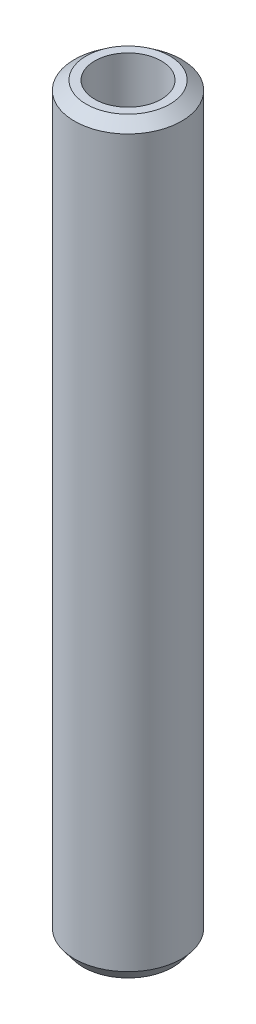
ISO-10303-21;
HEADER;
FILE_DESCRIPTION(('STEP AP214'),'2;1');
FILE_NAME('part.step','',(''),(''),'','','');
FILE_SCHEMA(('AUTOMOTIVE_DESIGN { 1 0 10303 214 1 1 1 1 }'));
ENDSEC;
DATA;
#1=APPLICATION_CONTEXT('core data for automotive mechanical design processes');
#2=APPLICATION_PROTOCOL_DEFINITION('international standard','automotive_design',2000,#1);
#3=PRODUCT_CONTEXT('',#1,'mechanical');
#4=PRODUCT('Part','Part','',(#3));
#5=PRODUCT_RELATED_PRODUCT_CATEGORY('part','',(#4));
#6=PRODUCT_DEFINITION_FORMATION('','',#4);
#7=PRODUCT_DEFINITION_CONTEXT('part definition',#1,'design');
#8=PRODUCT_DEFINITION('design','',#6,#7);
#9=PRODUCT_DEFINITION_SHAPE('','',#8);
#10=(LENGTH_UNIT() NAMED_UNIT(*) SI_UNIT(.MILLI.,.METRE.));
#11=(NAMED_UNIT(*) PLANE_ANGLE_UNIT() SI_UNIT($,.RADIAN.));
#12=(NAMED_UNIT(*) SI_UNIT($,.STERADIAN.) SOLID_ANGLE_UNIT());
#13=UNCERTAINTY_MEASURE_WITH_UNIT(LENGTH_MEASURE(1.E-05),#10,'distance_accuracy_value','');
#14=(GEOMETRIC_REPRESENTATION_CONTEXT(3) GLOBAL_UNCERTAINTY_ASSIGNED_CONTEXT((#13)) GLOBAL_UNIT_ASSIGNED_CONTEXT((#10,
#11,#12)) REPRESENTATION_CONTEXT('',''));
#15=CARTESIAN_POINT('',(0.,0.,0.));
#16=DIRECTION('',(0.,0.,1.));
#17=DIRECTION('',(1.,0.,0.));
#18=AXIS2_PLACEMENT_3D('',#15,#16,#17);
#19=CARTESIAN_POINT('',(0.,313.52081872691,0.));
#20=DIRECTION('',(0.,-1.,0.));
#21=DIRECTION('',(0.,0.,-1.));
#22=AXIS2_PLACEMENT_3D('',#19,#20,#21);
#23=CYLINDRICAL_SURFACE('',#22,22.5);
#24=CARTESIAN_POINT('',(0.,309.796443542068,0.));
#25=DIRECTION('',(0.,1.,0.));
#26=DIRECTION('',(0.,0.,1.));
#27=AXIS2_PLACEMENT_3D('',#24,#25,#26);
#28=CIRCLE('',#27,22.5);
#29=CARTESIAN_POINT('',(0.,309.796443542068,-22.5));
#30=VERTEX_POINT('',#29);
#31=EDGE_CURVE('E50',#30,#30,#28,.F.);
#32=CARTESIAN_POINT('',(0.,4.93507509069191,0.));
#33=DIRECTION('',(0.,1.,0.));
#34=DIRECTION('',(0.,0.,1.));
#35=AXIS2_PLACEMENT_3D('',#32,#33,#34);
#36=CIRCLE('',#35,22.5);
#37=CARTESIAN_POINT('',(0.,4.93507509069185,-22.5));
#38=VERTEX_POINT('',#37);
#39=EDGE_CURVE('E51',#38,#38,#36,.T.);
#40=CARTESIAN_POINT('',(0.,309.796443542068,-22.5));
#41=CARTESIAN_POINT('',(0.,306.620804287366,-22.5));
#42=CARTESIAN_POINT('',(0.,303.445165032664,-22.5));
#43=CARTESIAN_POINT('',(0.,297.093886523261,-22.5));
#44=CARTESIAN_POINT('',(0.,293.918247268559,-22.5));
#45=CARTESIAN_POINT('',(0.,287.566968759155,-22.5));
#46=CARTESIAN_POINT('',(0.,284.391329504453,-22.5));
#47=CARTESIAN_POINT('',(0.,278.04005099505,-22.5));
#48=CARTESIAN_POINT('',(0.,274.864411740348,-22.5));
#49=CARTESIAN_POINT('',(0.,268.513133230944,-22.5));
#50=CARTESIAN_POINT('',(0.,265.337493976242,-22.5));
#51=CARTESIAN_POINT('',(0.,258.986215466839,-22.5));
#52=CARTESIAN_POINT('',(0.,255.810576212137,-22.5));
#53=CARTESIAN_POINT('',(0.,249.459297702733,-22.5));
#54=CARTESIAN_POINT('',(0.,246.283658448031,-22.5));
#55=CARTESIAN_POINT('',(0.,239.932379938628,-22.5));
#56=CARTESIAN_POINT('',(0.,236.756740683926,-22.5));
#57=CARTESIAN_POINT('',(0.,230.405462174522,-22.5));
#58=CARTESIAN_POINT('',(0.,227.22982291982,-22.5));
#59=CARTESIAN_POINT('',(0.,220.878544410417,-22.5));
#60=CARTESIAN_POINT('',(0.,217.702905155715,-22.5));
#61=CARTESIAN_POINT('',(0.,211.351626646311,-22.5));
#62=CARTESIAN_POINT('',(0.,208.175987391609,-22.5));
#63=CARTESIAN_POINT('',(0.,201.824708882206,-22.5));
#64=CARTESIAN_POINT('',(0.,198.649069627504,-22.5));
#65=CARTESIAN_POINT('',(0.,192.2977911181,-22.5));
#66=CARTESIAN_POINT('',(0.,189.122151863398,-22.5));
#67=CARTESIAN_POINT('',(0.,182.770873353995,-22.5));
#68=CARTESIAN_POINT('',(0.,179.595234099293,-22.5));
#69=CARTESIAN_POINT('',(0.,173.243955589889,-22.5));
#70=CARTESIAN_POINT('',(0.,170.068316335187,-22.5));
#71=CARTESIAN_POINT('',(0.,163.717037825784,-22.5));
#72=CARTESIAN_POINT('',(0.,160.541398571082,-22.5));
#73=CARTESIAN_POINT('',(0.,154.190120061678,-22.5));
#74=CARTESIAN_POINT('',(0.,151.014480806976,-22.5));
#75=CARTESIAN_POINT('',(0.,144.663202297573,-22.5));
#76=CARTESIAN_POINT('',(0.,141.487563042871,-22.5));
#77=CARTESIAN_POINT('',(0.,135.136284533467,-22.5));
#78=CARTESIAN_POINT('',(0.,131.960645278765,-22.5));
#79=CARTESIAN_POINT('',(0.,125.609366769362,-22.5));
#80=CARTESIAN_POINT('',(0.,122.43372751466,-22.5));
#81=CARTESIAN_POINT('',(0.,116.082449005256,-22.5));
#82=CARTESIAN_POINT('',(0.,112.906809750554,-22.5));
#83=CARTESIAN_POINT('',(0.,106.555531241151,-22.5));
#84=CARTESIAN_POINT('',(0.,103.379891986449,-22.5));
#85=CARTESIAN_POINT('',(0.,97.0286134770451,-22.5));
#86=CARTESIAN_POINT('',(0.,93.8529742223433,-22.5));
#87=CARTESIAN_POINT('',(0.,87.5016957129396,-22.5));
#88=CARTESIAN_POINT('',(0.,84.3260564582378,-22.5));
#89=CARTESIAN_POINT('',(0.,77.9747779488341,-22.5));
#90=CARTESIAN_POINT('',(0.,74.7991386941323,-22.5));
#91=CARTESIAN_POINT('',(0.,68.4478601847286,-22.5));
#92=CARTESIAN_POINT('',(0.,65.2722209300268,-22.5));
#93=CARTESIAN_POINT('',(0.,58.9209424206231,-22.5));
#94=CARTESIAN_POINT('',(0.,55.7453031659213,-22.5));
#95=CARTESIAN_POINT('',(0.,49.3940246565176,-22.5));
#96=CARTESIAN_POINT('',(0.,46.2183854018157,-22.5));
#97=CARTESIAN_POINT('',(0.,39.8671068924121,-22.5));
#98=CARTESIAN_POINT('',(0.,36.6914676377102,-22.5));
#99=CARTESIAN_POINT('',(0.,30.3401891283065,-22.5));
#100=CARTESIAN_POINT('',(0.,27.1645498736047,-22.5));
#101=CARTESIAN_POINT('',(0.,20.813271364201,-22.5));
#102=CARTESIAN_POINT('',(0.,17.6376321094992,-22.5));
#103=CARTESIAN_POINT('',(0.,11.2863536000955,-22.5));
#104=CARTESIAN_POINT('',(0.,8.1107143453937,-22.5));
#105=CARTESIAN_POINT('',(0.,4.93507509069185,-22.5));
#106=B_SPLINE_CURVE_WITH_KNOTS('',3,(#40,#41,#42,#43,#44,#45,#46,#47,#48,#49,#50,#51,#52,#53,
#54,#55,#56,#57,#58,#59,#60,#61,#62,#63,#64,#65,#66,#67,#68,#69,#70,#71,#72,#73,#74,#75,#76,#77,
#78,#79,#80,#81,#82,#83,#84,#85,#86,#87,#88,#89,#90,#91,#92,#93,#94,#95,#96,#97,#98,#99,#100,
#101,#102,#103,#104,#105),.UNSPECIFIED.,.F.,.F.,(4,2,2,2,2,2,2,2,2,2,2,2,2,2,2,2,2,2,2,2,2,2,2,
2,2,2,2,2,2,2,2,2,4),(0.,9.52691776410547,19.053835528211,28.5807532923165,38.107671056422,
47.6345888205275,57.161506584633,66.6884243487385,76.215342112844,85.7422598769496,
95.2691776410551,104.796095405161,114.323013169266,123.849930933372,133.376848697477,
142.903766461583,152.430684225688,161.957601989794,171.484519753899,181.011437518005,
190.53835528211,200.065273046216,209.592190810321,219.119108574427,228.646026338532,
238.172944102638,247.699861866743,257.226779630849,266.753697394954,276.28061515906,
285.807532923165,295.334450687271,304.861368451376),.UNSPECIFIED.);
#107=EDGE_CURVE('BSEAM39',#30,#38,#106,.T.);
#108=ORIENTED_EDGE('',*,*,#31,.T.);
#109=ORIENTED_EDGE('',*,*,#39,.T.);
#110=ORIENTED_EDGE('',*,*,#107,.T.);
#111=ORIENTED_EDGE('',*,*,#107,.F.);
#112=EDGE_LOOP('',(#108,#110,#109,#111));
#113=FACE_BOUND('',#112,.T.);
#114=ADVANCED_FACE('F39',(#113),#23,.T.);
#115=CARTESIAN_POINT('',(0.,313.52081872691,0.));
#116=DIRECTION('',(0.,1.,0.));
#117=DIRECTION('',(0.,0.,1.));
#118=AXIS2_PLACEMENT_3D('',#115,#116,#117);
#119=PLANE('',#118);
#120=CARTESIAN_POINT('',(0.,313.52081872691,0.));
#121=DIRECTION('',(0.,1.,0.));
#122=DIRECTION('',(0.,0.,1.));
#123=AXIS2_PLACEMENT_3D('',#120,#121,#122);
#124=CIRCLE('',#123,17.5649249093087);
#125=CARTESIAN_POINT('',(0.,313.52081872691,17.5649249093087));
#126=VERTEX_POINT('',#125);
#127=EDGE_CURVE('E54',#126,#126,#124,.T.);
#128=ORIENTED_EDGE('',*,*,#127,.T.);
#129=EDGE_LOOP('',(#128));
#130=FACE_BOUND('',#129,.T.);
#131=CARTESIAN_POINT('',(0.,313.52081872691,0.));
#132=DIRECTION('',(0.,1.,0.));
#133=DIRECTION('',(0.,0.,1.));
#134=AXIS2_PLACEMENT_3D('',#131,#132,#133);
#135=CIRCLE('',#134,13.9803998994725);
#136=CARTESIAN_POINT('',(0.,313.520818726909,-13.9803998994725));
#137=VERTEX_POINT('',#136);
#138=EDGE_CURVE('E58',#137,#137,#135,.T.);
#139=ORIENTED_EDGE('',*,*,#138,.F.);
#140=EDGE_LOOP('',(#139));
#141=FACE_BOUND('',#140,.T.);
#142=ADVANCED_FACE('F69',(#130,#141),#119,.T.);
#143=CARTESIAN_POINT('',(0.,0.,0.));
#144=DIRECTION('',(0.,1.,0.));
#145=DIRECTION('',(0.,0.,1.));
#146=AXIS2_PLACEMENT_3D('',#143,#144,#145);
#147=PLANE('',#146);
#148=CARTESIAN_POINT('',(0.,0.,0.));
#149=DIRECTION('',(0.,1.,0.));
#150=DIRECTION('',(0.,0.,1.));
#151=AXIS2_PLACEMENT_3D('',#148,#149,#150);
#152=CIRCLE('',#151,18.7756248151582);
#153=CARTESIAN_POINT('',(0.,0.,18.7756248151582));
#154=VERTEX_POINT('',#153);
#155=EDGE_CURVE('E10',#154,#154,#152,.F.);
#156=ORIENTED_EDGE('',*,*,#155,.T.);
#157=EDGE_LOOP('',(#156));
#158=FACE_BOUND('',#157,.T.);
#159=CARTESIAN_POINT('',(0.,0.,0.));
#160=DIRECTION('',(0.,1.,0.));
#161=DIRECTION('',(0.,0.,1.));
#162=AXIS2_PLACEMENT_3D('',#159,#160,#161);
#163=CIRCLE('',#162,13.9803998994725);
#164=CARTESIAN_POINT('',(0.,0.,-13.9803998994725));
#165=VERTEX_POINT('',#164);
#166=EDGE_CURVE('E63',#165,#165,#163,.T.);
#167=ORIENTED_EDGE('',*,*,#166,.T.);
#168=EDGE_LOOP('',(#167));
#169=FACE_BOUND('',#168,.T.);
#170=ADVANCED_FACE('F75',(#158,#169),#147,.F.);
#171=CARTESIAN_POINT('',(0.,313.52081872691,0.));
#172=DIRECTION('',(0.,-1.,0.));
#173=DIRECTION('',(0.,0.,-1.));
#174=AXIS2_PLACEMENT_3D('',#171,#172,#173);
#175=CYLINDRICAL_SURFACE('',#174,13.9803998994725);
#176=CARTESIAN_POINT('',(0.,313.520818726909,-13.9803998994725));
#177=CARTESIAN_POINT('',(0.,310.254976865171,-13.9803998994725));
#178=CARTESIAN_POINT('',(0.,306.989135003432,-13.9803998994725));
#179=CARTESIAN_POINT('',(0.,300.457451279955,-13.9803998994725));
#180=CARTESIAN_POINT('',(0.,297.191609418216,-13.9803998994725));
#181=CARTESIAN_POINT('',(0.,290.659925694739,-13.9803998994725));
#182=CARTESIAN_POINT('',(0.,287.394083833,-13.9803998994725));
#183=CARTESIAN_POINT('',(0.,280.862400109523,-13.9803998994725));
#184=CARTESIAN_POINT('',(0.,277.596558247784,-13.9803998994725));
#185=CARTESIAN_POINT('',(0.,271.064874524307,-13.9803998994725));
#186=CARTESIAN_POINT('',(0.,267.799032662568,-13.9803998994725));
#187=CARTESIAN_POINT('',(0.,261.267348939091,-13.9803998994725));
#188=CARTESIAN_POINT('',(0.,258.001507077353,-13.9803998994725));
#189=CARTESIAN_POINT('',(0.,251.469823353875,-13.9803998994725));
#190=CARTESIAN_POINT('',(0.,248.203981492137,-13.9803998994725));
#191=CARTESIAN_POINT('',(0.,241.672297768659,-13.9803998994725));
#192=CARTESIAN_POINT('',(0.,238.406455906921,-13.9803998994725));
#193=CARTESIAN_POINT('',(0.,231.874772183443,-13.9803998994725));
#194=CARTESIAN_POINT('',(0.,228.608930321705,-13.9803998994725));
#195=CARTESIAN_POINT('',(0.,222.077246598228,-13.9803998994725));
#196=CARTESIAN_POINT('',(0.,218.811404736489,-13.9803998994725));
#197=CARTESIAN_POINT('',(0.,212.279721013012,-13.9803998994725));
#198=CARTESIAN_POINT('',(0.,209.013879151273,-13.9803998994725));
#199=CARTESIAN_POINT('',(0.,202.482195427796,-13.9803998994725));
#200=CARTESIAN_POINT('',(0.,199.216353566057,-13.9803998994725));
#201=CARTESIAN_POINT('',(0.,192.68466984258,-13.9803998994725));
#202=CARTESIAN_POINT('',(0.,189.418827980841,-13.9803998994725));
#203=CARTESIAN_POINT('',(0.,182.887144257364,-13.9803998994725));
#204=CARTESIAN_POINT('',(0.,179.621302395625,-13.9803998994725));
#205=CARTESIAN_POINT('',(0.,173.089618672148,-13.9803998994725));
#206=CARTESIAN_POINT('',(0.,169.823776810409,-13.9803998994725));
#207=CARTESIAN_POINT('',(0.,163.292093086932,-13.9803998994725));
#208=CARTESIAN_POINT('',(0.,160.026251225193,-13.9803998994725));
#209=CARTESIAN_POINT('',(0.,153.494567501716,-13.9803998994725));
#210=CARTESIAN_POINT('',(0.,150.228725639977,-13.9803998994725));
#211=CARTESIAN_POINT('',(0.,143.6970419165,-13.9803998994725));
#212=CARTESIAN_POINT('',(0.,140.431200054762,-13.9803998994725));
#213=CARTESIAN_POINT('',(0.,133.899516331284,-13.9803998994725));
#214=CARTESIAN_POINT('',(0.,130.633674469546,-13.9803998994725));
#215=CARTESIAN_POINT('',(0.,124.101990746068,-13.9803998994725));
#216=CARTESIAN_POINT('',(0.,120.83614888433,-13.9803998994725));
#217=CARTESIAN_POINT('',(0.,114.304465160852,-13.9803998994725));
#218=CARTESIAN_POINT('',(0.,111.038623299114,-13.9803998994725));
#219=CARTESIAN_POINT('',(0.,104.506939575636,-13.9803998994725));
#220=CARTESIAN_POINT('',(0.,101.241097713898,-13.9803998994725));
#221=CARTESIAN_POINT('',(0.,94.7094139904205,-13.9803998994725));
#222=CARTESIAN_POINT('',(0.,91.4435721286819,-13.9803998994725));
#223=CARTESIAN_POINT('',(0.,84.9118884052046,-13.9803998994725));
#224=CARTESIAN_POINT('',(0.,81.646046543466,-13.9803998994725));
#225=CARTESIAN_POINT('',(0.,75.1143628199887,-13.9803998994725));
#226=CARTESIAN_POINT('',(0.,71.8485209582501,-13.9803998994725));
#227=CARTESIAN_POINT('',(0.,65.3168372347728,-13.9803998994725));
#228=CARTESIAN_POINT('',(0.,62.0509953730341,-13.9803998994725));
#229=CARTESIAN_POINT('',(0.,55.5193116495568,-13.9803998994725));
#230=CARTESIAN_POINT('',(0.,52.2534697878182,-13.9803998994725));
#231=CARTESIAN_POINT('',(0.,45.7217860643409,-13.9803998994725));
#232=CARTESIAN_POINT('',(0.,42.4559442026023,-13.9803998994725));
#233=CARTESIAN_POINT('',(0.,35.924260479125,-13.9803998994725));
#234=CARTESIAN_POINT('',(0.,32.6584186173864,-13.9803998994725));
#235=CARTESIAN_POINT('',(0.,26.1267348939091,-13.9803998994725));
#236=CARTESIAN_POINT('',(0.,22.8608930321704,-13.9803998994725));
#237=CARTESIAN_POINT('',(0.,16.3292093086932,-13.9803998994725));
#238=CARTESIAN_POINT('',(0.,13.0633674469545,-13.9803998994725));
#239=CARTESIAN_POINT('',(0.,6.53168372347722,-13.9803998994725));
#240=CARTESIAN_POINT('',(0.,3.26584186173858,-13.9803998994725));
#241=CARTESIAN_POINT('',(0.,0.,-13.9803998994725));
#242=B_SPLINE_CURVE_WITH_KNOTS('',3,(#176,#177,#178,#179,#180,#181,#182,#183,#184,#185,#186,
#187,#188,#189,#190,#191,#192,#193,#194,#195,#196,#197,#198,#199,#200,#201,#202,#203,#204,#205,
#206,#207,#208,#209,#210,#211,#212,#213,#214,#215,#216,#217,#218,#219,#220,#221,#222,#223,#224,
#225,#226,#227,#228,#229,#230,#231,#232,#233,#234,#235,#236,#237,#238,#239,#240,#241),
.UNSPECIFIED.,.F.,.F.,(4,2,2,2,2,2,2,2,2,2,2,2,2,2,2,2,2,2,2,2,2,2,2,2,2,2,2,2,2,2,2,2,4),(0.,
9.7975255852159,19.5950511704318,29.3925767556477,39.1901023408637,48.9876279260796,
58.7851535112955,68.5826790965114,78.3802046817273,88.1777302669433,97.9752558521592,
107.772781437375,117.570307022591,127.367832607807,137.165358193023,146.962883778239,
156.760409363455,166.557934948671,176.355460533887,186.152986119103,195.950511704318,
205.748037289534,215.54556287475,225.343088459966,235.140614045182,244.938139630398,
254.735665215614,264.53319080083,274.330716386046,284.128241971262,293.925767556478,
303.723293141694,313.52081872691),.UNSPECIFIED.);
#243=EDGE_CURVE('BSEAM70',#137,#165,#242,.T.);
#244=ORIENTED_EDGE('',*,*,#138,.T.);
#245=ORIENTED_EDGE('',*,*,#166,.F.);
#246=ORIENTED_EDGE('',*,*,#243,.T.);
#247=ORIENTED_EDGE('',*,*,#243,.F.);
#248=EDGE_LOOP('',(#244,#246,#245,#247));
#249=FACE_BOUND('',#248,.T.);
#250=ADVANCED_FACE('F70',(#249),#175,.F.);
#251=CARTESIAN_POINT('',(0.,313.52081872691,0.));
#252=DIRECTION('',(0.,-1.,0.));
#253=DIRECTION('',(0.,0.,-1.));
#254=AXIS2_PLACEMENT_3D('',#251,#252,#253);
#255=CONICAL_SURFACE('',#254,17.5649249093087,0.924310262743618);
#256=ORIENTED_EDGE('',*,*,#31,.F.);
#257=EDGE_LOOP('',(#256));
#258=FACE_BOUND('',#257,.T.);
#259=ORIENTED_EDGE('',*,*,#127,.F.);
#260=EDGE_LOOP('',(#259));
#261=FACE_BOUND('',#260,.T.);
#262=ADVANCED_FACE('F81',(#258,#261),#255,.T.);
#263=CARTESIAN_POINT('',(0.,4.93507509069191,0.));
#264=DIRECTION('',(0.,1.,0.));
#265=DIRECTION('',(0.,0.,1.));
#266=AXIS2_PLACEMENT_3D('',#263,#264,#265);
#267=CONICAL_SURFACE('',#266,22.5,0.646486064051279);
#268=ORIENTED_EDGE('',*,*,#155,.F.);
#269=EDGE_LOOP('',(#268));
#270=FACE_BOUND('',#269,.T.);
#271=ORIENTED_EDGE('',*,*,#39,.F.);
#272=EDGE_LOOP('',(#271));
#273=FACE_BOUND('',#272,.T.);
#274=ADVANCED_FACE('F45',(#270,#273),#267,.T.);
#275=CLOSED_SHELL('',(#114,#142,#170,#250,#262,#274));
#276=MANIFOLD_SOLID_BREP('B2',#275);
#277=ADVANCED_BREP_SHAPE_REPRESENTATION('',(#18,#276),#14);
#278=SHAPE_DEFINITION_REPRESENTATION(#9,#277);
ENDSEC;
END-ISO-10303-21;
